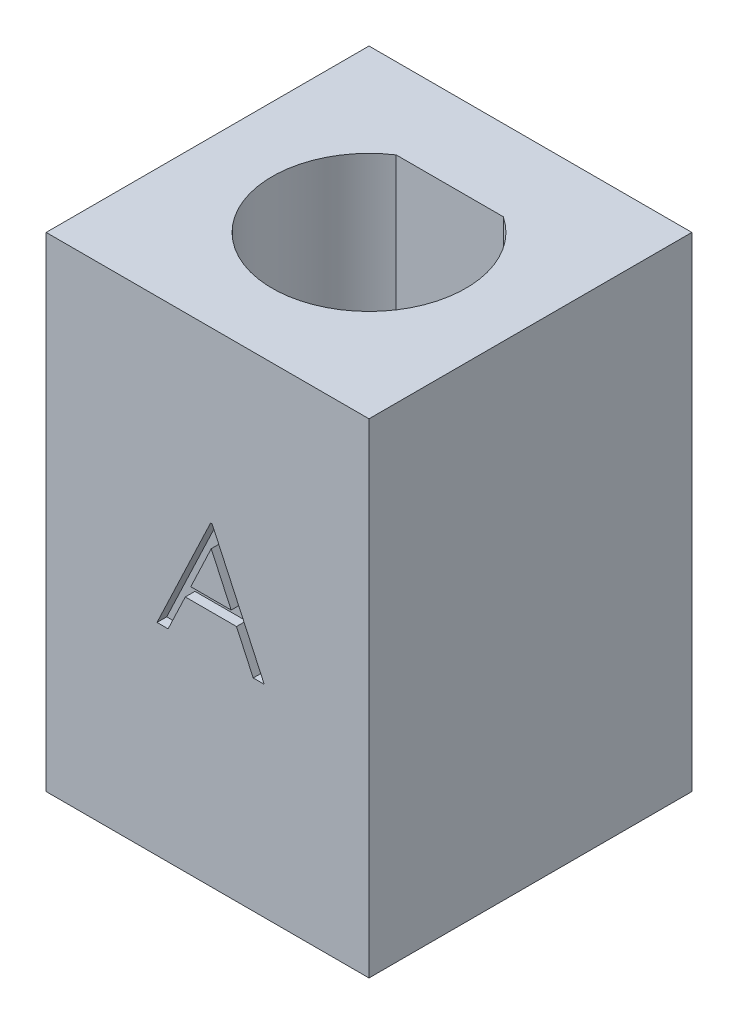
ISO-10303-21;
HEADER;
FILE_DESCRIPTION(('STEP AP214'),'2;1');
FILE_NAME('part.step','',(''),(''),'','','');
FILE_SCHEMA(('AUTOMOTIVE_DESIGN { 1 0 10303 214 1 1 1 1 }'));
ENDSEC;
DATA;
#1=APPLICATION_CONTEXT('core data for automotive mechanical design processes');
#2=APPLICATION_PROTOCOL_DEFINITION('international standard','automotive_design',2000,#1);
#3=PRODUCT_CONTEXT('',#1,'mechanical');
#4=PRODUCT('Part','Part','',(#3));
#5=PRODUCT_RELATED_PRODUCT_CATEGORY('part','',(#4));
#6=PRODUCT_DEFINITION_FORMATION('','',#4);
#7=PRODUCT_DEFINITION_CONTEXT('part definition',#1,'design');
#8=PRODUCT_DEFINITION('design','',#6,#7);
#9=PRODUCT_DEFINITION_SHAPE('','',#8);
#10=(LENGTH_UNIT() NAMED_UNIT(*) SI_UNIT(.MILLI.,.METRE.));
#11=(NAMED_UNIT(*) PLANE_ANGLE_UNIT() SI_UNIT($,.RADIAN.));
#12=(NAMED_UNIT(*) SI_UNIT($,.STERADIAN.) SOLID_ANGLE_UNIT());
#13=UNCERTAINTY_MEASURE_WITH_UNIT(LENGTH_MEASURE(1.E-05),#10,'distance_accuracy_value','');
#14=(GEOMETRIC_REPRESENTATION_CONTEXT(3) GLOBAL_UNCERTAINTY_ASSIGNED_CONTEXT((#13)) GLOBAL_UNIT_ASSIGNED_CONTEXT((#10,
#11,#12)) REPRESENTATION_CONTEXT('',''));
#15=CARTESIAN_POINT('',(0.,0.,0.));
#16=DIRECTION('',(0.,0.,1.));
#17=DIRECTION('',(1.,0.,0.));
#18=AXIS2_PLACEMENT_3D('',#15,#16,#17);
#19=CARTESIAN_POINT('',(-5.,15.,5.));
#20=DIRECTION('',(0.,0.,-1.));
#21=DIRECTION('',(-1.,0.,0.));
#22=AXIS2_PLACEMENT_3D('',#19,#20,#21);
#23=PLANE('',#22);
#24=DIRECTION('',(1.,0.,0.));
#25=VECTOR('',#24,1.);
#26=CARTESIAN_POINT('',(-5.,0.,5.));
#27=LINE('',#26,#25);
#28=CARTESIAN_POINT('',(-5.,0.,5.));
#29=VERTEX_POINT('',#28);
#30=CARTESIAN_POINT('',(5.,0.,5.));
#31=VERTEX_POINT('',#30);
#32=EDGE_CURVE('E327',#29,#31,#27,.T.);
#33=ORIENTED_EDGE('',*,*,#32,.T.);
#34=DIRECTION('',(0.,-1.,0.));
#35=VECTOR('',#34,1.);
#36=CARTESIAN_POINT('',(5.,15.,5.));
#37=LINE('',#36,#35);
#38=CARTESIAN_POINT('',(5.,15.,5.));
#39=VERTEX_POINT('',#38);
#40=EDGE_CURVE('E52',#39,#31,#37,.T.);
#41=ORIENTED_EDGE('',*,*,#40,.F.);
#42=DIRECTION('',(1.,0.,0.));
#43=VECTOR('',#42,1.);
#44=CARTESIAN_POINT('',(-5.,15.,5.));
#45=LINE('',#44,#43);
#46=CARTESIAN_POINT('',(-5.,15.,5.));
#47=VERTEX_POINT('',#46);
#48=EDGE_CURVE('E313',#47,#39,#45,.T.);
#49=ORIENTED_EDGE('',*,*,#48,.F.);
#50=DIRECTION('',(0.,-1.,0.));
#51=VECTOR('',#50,1.);
#52=CARTESIAN_POINT('',(-5.,15.,5.));
#53=LINE('',#52,#51);
#54=EDGE_CURVE('E11',#47,#29,#53,.T.);
#55=ORIENTED_EDGE('',*,*,#54,.T.);
#56=EDGE_LOOP('',(#33,#41,#49,#55));
#57=FACE_BOUND('',#56,.T.);
#58=DIRECTION('',(1.,0.,0.));
#59=VECTOR('',#58,1.);
#60=CARTESIAN_POINT('',(0.094663212809988,9.75483865440246,5.));
#61=LINE('',#60,#59);
#62=CARTESIAN_POINT('',(0.094663212809986,9.75483865440246,5.));
#63=VERTEX_POINT('',#62);
#64=CARTESIAN_POINT('',(0.139535007681783,9.75483865440246,5.));
#65=VERTEX_POINT('',#64);
#66=EDGE_CURVE('E59',#63,#65,#61,.T.);
#67=ORIENTED_EDGE('',*,*,#66,.T.);
#68=DIRECTION('',(0.419058177461747,-0.907959384500452,0.));
#69=VECTOR('',#68,1.);
#70=CARTESIAN_POINT('',(0.139535007681783,9.75483865440246,5.));
#71=LINE('',#70,#69);
#72=CARTESIAN_POINT('',(1.7549196230664,6.25483865440246,5.));
#73=VERTEX_POINT('',#72);
#74=EDGE_CURVE('E235',#65,#73,#71,.T.);
#75=ORIENTED_EDGE('',*,*,#74,.T.);
#76=DIRECTION('',(-1.,0.,0.));
#77=VECTOR('',#76,1.);
#78=CARTESIAN_POINT('',(1.7549196230664,6.25483865440246,5.));
#79=LINE('',#78,#77);
#80=CARTESIAN_POINT('',(1.41347330896383,6.25483865440246,5.));
#81=VERTEX_POINT('',#80);
#82=EDGE_CURVE('E239',#73,#81,#79,.T.);
#83=ORIENTED_EDGE('',*,*,#82,.T.);
#84=DIRECTION('',(-0.418842224744609,0.90805902383655,0.));
#85=VECTOR('',#84,1.);
#86=CARTESIAN_POINT('',(1.41347330896383,6.25483865440246,5.));
#87=LINE('',#86,#85);
#88=CARTESIAN_POINT('',(0.896045424348449,7.37663352619734,5.));
#89=VERTEX_POINT('',#88);
#90=EDGE_CURVE('E243',#81,#89,#87,.T.);
#91=ORIENTED_EDGE('',*,*,#90,.T.);
#92=DIRECTION('',(-1.,0.,0.));
#93=VECTOR('',#92,1.);
#94=CARTESIAN_POINT('',(0.896045424348449,7.37663352619734,5.));
#95=LINE('',#94,#93);
#96=CARTESIAN_POINT('',(-0.690593197446422,7.37663352619734,5.));
#97=VERTEX_POINT('',#96);
#98=EDGE_CURVE('E247',#89,#97,#95,.T.);
#99=ORIENTED_EDGE('',*,*,#98,.T.);
#100=DIRECTION('',(-0.428596026355544,-0.903496234741594,0.));
#101=VECTOR('',#100,1.);
#102=CARTESIAN_POINT('',(-0.690593197446422,7.37663352619734,5.));
#103=LINE('',#102,#101);
#104=CARTESIAN_POINT('',(-1.22274463975411,6.25483865440246,5.));
#105=VERTEX_POINT('',#104);
#106=EDGE_CURVE('E251',#97,#105,#103,.T.);
#107=ORIENTED_EDGE('',*,*,#106,.T.);
#108=DIRECTION('',(-1.,0.,0.));
#109=VECTOR('',#108,1.);
#110=CARTESIAN_POINT('',(-1.22274463975411,6.25483865440246,5.));
#111=LINE('',#110,#109);
#112=CARTESIAN_POINT('',(-1.56559319744642,6.25483865440246,5.));
#113=VERTEX_POINT('',#112);
#114=EDGE_CURVE('E255',#105,#113,#111,.T.);
#115=ORIENTED_EDGE('',*,*,#114,.T.);
#116=DIRECTION('',(0.428584206872173,0.903501841514311,0.));
#117=VECTOR('',#116,1.);
#118=CARTESIAN_POINT('',(-1.56559319744642,6.25483865440246,5.));
#119=LINE('',#118,#117);
#120=EDGE_CURVE('E211',#113,#63,#119,.T.);
#121=ORIENTED_EDGE('',*,*,#120,.T.);
#122=EDGE_LOOP('',(#67,#75,#83,#91,#99,#107,#115,#121));
#123=FACE_BOUND('',#122,.T.);
#124=ADVANCED_FACE('F43',(#57,#123),#23,.F.);
#125=CARTESIAN_POINT('',(0.,15.,0.));
#126=DIRECTION('',(0.,1.,0.));
#127=DIRECTION('',(0.,0.,1.));
#128=AXIS2_PLACEMENT_3D('',#125,#126,#127);
#129=PLANE('',#128);
#130=DIRECTION('',(0.,0.,1.));
#131=VECTOR('',#130,1.);
#132=CARTESIAN_POINT('',(-5.,15.,-5.));
#133=LINE('',#132,#131);
#134=CARTESIAN_POINT('',(-5.,15.,-5.));
#135=VERTEX_POINT('',#134);
#136=EDGE_CURVE('E309',#135,#47,#133,.T.);
#137=ORIENTED_EDGE('',*,*,#136,.T.);
#138=ORIENTED_EDGE('',*,*,#48,.T.);
#139=DIRECTION('',(0.,0.,-1.));
#140=VECTOR('',#139,1.);
#141=CARTESIAN_POINT('',(5.,15.,-5.));
#142=LINE('',#141,#140);
#143=CARTESIAN_POINT('',(5.,15.,-5.));
#144=VERTEX_POINT('',#143);
#145=EDGE_CURVE('E317',#39,#144,#142,.T.);
#146=ORIENTED_EDGE('',*,*,#145,.T.);
#147=DIRECTION('',(-1.,0.,0.));
#148=VECTOR('',#147,1.);
#149=CARTESIAN_POINT('',(-5.,15.,-5.));
#150=LINE('',#149,#148);
#151=EDGE_CURVE('E320',#144,#135,#150,.T.);
#152=ORIENTED_EDGE('',*,*,#151,.T.);
#153=EDGE_LOOP('',(#137,#138,#146,#152));
#154=FACE_BOUND('',#153,.T.);
#155=DIRECTION('',(-1.,0.,0.));
#156=VECTOR('',#155,1.);
#157=CARTESIAN_POINT('',(-1.6583123951777,15.,-2.5));
#158=LINE('',#157,#156);
#159=CARTESIAN_POINT('',(1.6583123951777,15.,-2.5));
#160=VERTEX_POINT('',#159);
#161=CARTESIAN_POINT('',(-1.6583123951777,15.,-2.5));
#162=VERTEX_POINT('',#161);
#163=EDGE_CURVE('E290',#160,#162,#158,.T.);
#164=ORIENTED_EDGE('',*,*,#163,.F.);
#165=CARTESIAN_POINT('',(0.,15.,0.));
#166=DIRECTION('',(0.,1.,0.));
#167=DIRECTION('',(0.,0.,1.));
#168=AXIS2_PLACEMENT_3D('',#165,#166,#167);
#169=CIRCLE('',#168,3.);
#170=EDGE_CURVE('E286',#162,#160,#169,.T.);
#171=ORIENTED_EDGE('',*,*,#170,.F.);
#172=EDGE_LOOP('',(#164,#171));
#173=FACE_BOUND('',#172,.T.);
#174=ADVANCED_FACE('F363',(#154,#173),#129,.T.);
#175=CARTESIAN_POINT('',(0.,0.,0.));
#176=DIRECTION('',(0.,1.,0.));
#177=DIRECTION('',(0.,0.,1.));
#178=AXIS2_PLACEMENT_3D('',#175,#176,#177);
#179=PLANE('',#178);
#180=DIRECTION('',(0.,0.,1.));
#181=VECTOR('',#180,1.);
#182=CARTESIAN_POINT('',(-5.,0.,-5.));
#183=LINE('',#182,#181);
#184=CARTESIAN_POINT('',(-5.,0.,-5.));
#185=VERTEX_POINT('',#184);
#186=EDGE_CURVE('E308',#185,#29,#183,.T.);
#187=ORIENTED_EDGE('',*,*,#186,.F.);
#188=DIRECTION('',(-1.,0.,0.));
#189=VECTOR('',#188,1.);
#190=CARTESIAN_POINT('',(-5.,0.,-5.));
#191=LINE('',#190,#189);
#192=CARTESIAN_POINT('',(5.,0.,-5.));
#193=VERTEX_POINT('',#192);
#194=EDGE_CURVE('E314',#193,#185,#191,.T.);
#195=ORIENTED_EDGE('',*,*,#194,.F.);
#196=DIRECTION('',(0.,0.,-1.));
#197=VECTOR('',#196,1.);
#198=CARTESIAN_POINT('',(5.,0.,-5.));
#199=LINE('',#198,#197);
#200=EDGE_CURVE('E330',#31,#193,#199,.T.);
#201=ORIENTED_EDGE('',*,*,#200,.F.);
#202=ORIENTED_EDGE('',*,*,#32,.F.);
#203=EDGE_LOOP('',(#187,#195,#201,#202));
#204=FACE_BOUND('',#203,.T.);
#205=CARTESIAN_POINT('',(0.,0.,0.));
#206=DIRECTION('',(0.,1.,0.));
#207=DIRECTION('',(0.,0.,1.));
#208=AXIS2_PLACEMENT_3D('',#205,#206,#207);
#209=CIRCLE('',#208,3.);
#210=CARTESIAN_POINT('',(-1.6583123951777,0.,-2.5));
#211=VERTEX_POINT('',#210);
#212=CARTESIAN_POINT('',(1.6583123951777,0.,-2.5));
#213=VERTEX_POINT('',#212);
#214=EDGE_CURVE('E285',#211,#213,#209,.T.);
#215=ORIENTED_EDGE('',*,*,#214,.T.);
#216=DIRECTION('',(-1.,0.,0.));
#217=VECTOR('',#216,1.);
#218=CARTESIAN_POINT('',(-1.6583123951777,0.,-2.5));
#219=LINE('',#218,#217);
#220=EDGE_CURVE('E291',#213,#211,#219,.T.);
#221=ORIENTED_EDGE('',*,*,#220,.T.);
#222=EDGE_LOOP('',(#215,#221));
#223=FACE_BOUND('',#222,.T.);
#224=ADVANCED_FACE('F353',(#204,#223),#179,.F.);
#225=CARTESIAN_POINT('',(-5.,15.,-5.));
#226=DIRECTION('',(1.,0.,0.));
#227=DIRECTION('',(0.,0.,-1.));
#228=AXIS2_PLACEMENT_3D('',#225,#226,#227);
#229=PLANE('',#228);
#230=ORIENTED_EDGE('',*,*,#186,.T.);
#231=ORIENTED_EDGE('',*,*,#54,.F.);
#232=ORIENTED_EDGE('',*,*,#136,.F.);
#233=DIRECTION('',(0.,-1.,0.));
#234=VECTOR('',#233,1.);
#235=CARTESIAN_POINT('',(-5.,15.,-5.));
#236=LINE('',#235,#234);
#237=EDGE_CURVE('E323',#135,#185,#236,.T.);
#238=ORIENTED_EDGE('',*,*,#237,.T.);
#239=EDGE_LOOP('',(#230,#231,#232,#238));
#240=FACE_BOUND('',#239,.T.);
#241=ADVANCED_FACE('F45',(#240),#229,.F.);
#242=CARTESIAN_POINT('',(5.,15.,-5.));
#243=DIRECTION('',(-1.,0.,0.));
#244=DIRECTION('',(0.,0.,1.));
#245=AXIS2_PLACEMENT_3D('',#242,#243,#244);
#246=PLANE('',#245);
#247=ORIENTED_EDGE('',*,*,#200,.T.);
#248=DIRECTION('',(0.,-1.,0.));
#249=VECTOR('',#248,1.);
#250=CARTESIAN_POINT('',(5.,15.,-5.));
#251=LINE('',#250,#249);
#252=EDGE_CURVE('E338',#144,#193,#251,.T.);
#253=ORIENTED_EDGE('',*,*,#252,.F.);
#254=ORIENTED_EDGE('',*,*,#145,.F.);
#255=ORIENTED_EDGE('',*,*,#40,.T.);
#256=EDGE_LOOP('',(#247,#253,#254,#255));
#257=FACE_BOUND('',#256,.T.);
#258=ADVANCED_FACE('F347',(#257),#246,.F.);
#259=CARTESIAN_POINT('',(-5.,15.,-5.));
#260=DIRECTION('',(0.,0.,1.));
#261=DIRECTION('',(1.,0.,0.));
#262=AXIS2_PLACEMENT_3D('',#259,#260,#261);
#263=PLANE('',#262);
#264=ORIENTED_EDGE('',*,*,#194,.T.);
#265=ORIENTED_EDGE('',*,*,#237,.F.);
#266=ORIENTED_EDGE('',*,*,#151,.F.);
#267=ORIENTED_EDGE('',*,*,#252,.T.);
#268=EDGE_LOOP('',(#264,#265,#266,#267));
#269=FACE_BOUND('',#268,.T.);
#270=ADVANCED_FACE('F357',(#269),#263,.F.);
#271=CARTESIAN_POINT('',(0.,15.,0.));
#272=DIRECTION('',(0.,-1.,0.));
#273=DIRECTION('',(0.,0.,-1.));
#274=AXIS2_PLACEMENT_3D('',#271,#272,#273);
#275=CYLINDRICAL_SURFACE('',#274,3.);
#276=ORIENTED_EDGE('',*,*,#214,.F.);
#277=DIRECTION('',(0.,-1.,0.));
#278=VECTOR('',#277,1.);
#279=CARTESIAN_POINT('',(-1.6583123951777,15.,-2.5));
#280=LINE('',#279,#278);
#281=EDGE_CURVE('E294',#162,#211,#280,.T.);
#282=ORIENTED_EDGE('',*,*,#281,.F.);
#283=ORIENTED_EDGE('',*,*,#170,.T.);
#284=DIRECTION('',(0.,-1.,0.));
#285=VECTOR('',#284,1.);
#286=CARTESIAN_POINT('',(1.6583123951777,15.,-2.5));
#287=LINE('',#286,#285);
#288=EDGE_CURVE('E304',#160,#213,#287,.T.);
#289=ORIENTED_EDGE('',*,*,#288,.T.);
#290=EDGE_LOOP('',(#276,#282,#283,#289));
#291=FACE_BOUND('',#290,.T.);
#292=ADVANCED_FACE('F426',(#291),#275,.F.);
#293=CARTESIAN_POINT('',(-1.6583123951777,15.,-2.5));
#294=DIRECTION('',(0.,0.,1.));
#295=DIRECTION('',(1.,0.,0.));
#296=AXIS2_PLACEMENT_3D('',#293,#294,#295);
#297=PLANE('',#296);
#298=ORIENTED_EDGE('',*,*,#220,.F.);
#299=ORIENTED_EDGE('',*,*,#288,.F.);
#300=ORIENTED_EDGE('',*,*,#163,.T.);
#301=ORIENTED_EDGE('',*,*,#281,.T.);
#302=EDGE_LOOP('',(#298,#299,#300,#301));
#303=FACE_BOUND('',#302,.T.);
#304=ADVANCED_FACE('F423',(#303),#297,.T.);
#305=CARTESIAN_POINT('',(0.094663212809988,9.75483865440246,4.7));
#306=DIRECTION('',(0.,-1.,0.));
#307=DIRECTION('',(0.,0.,-1.));
#308=AXIS2_PLACEMENT_3D('',#305,#306,#307);
#309=PLANE('',#308);
#310=ORIENTED_EDGE('',*,*,#66,.F.);
#311=DIRECTION('',(0.,0.,1.));
#312=VECTOR('',#311,1.);
#313=CARTESIAN_POINT('',(0.094663212809988,9.75483865440246,4.7));
#314=LINE('',#313,#312);
#315=CARTESIAN_POINT('',(0.094663212809988,9.75483865440246,4.7));
#316=VERTEX_POINT('',#315);
#317=EDGE_CURVE('E232',#316,#63,#314,.T.);
#318=ORIENTED_EDGE('',*,*,#317,.F.);
#319=DIRECTION('',(1.,0.,0.));
#320=VECTOR('',#319,1.);
#321=CARTESIAN_POINT('',(0.094663212809988,9.75483865440246,4.7));
#322=LINE('',#321,#320);
#323=CARTESIAN_POINT('',(0.139535007681783,9.75483865440246,4.7));
#324=VERTEX_POINT('',#323);
#325=EDGE_CURVE('E206',#316,#324,#322,.T.);
#326=ORIENTED_EDGE('',*,*,#325,.T.);
#327=DIRECTION('',(0.,0.,1.));
#328=VECTOR('',#327,1.);
#329=CARTESIAN_POINT('',(0.139535007681783,9.75483865440246,4.7));
#330=LINE('',#329,#328);
#331=EDGE_CURVE('E282',#324,#65,#330,.T.);
#332=ORIENTED_EDGE('',*,*,#331,.T.);
#333=EDGE_LOOP('',(#310,#318,#326,#332));
#334=FACE_BOUND('',#333,.T.);
#335=ADVANCED_FACE('F375',(#334),#309,.T.);
#336=CARTESIAN_POINT('',(0.139535007681783,9.75483865440246,4.7));
#337=DIRECTION('',(-0.907959384500452,-0.419058177461747,0.));
#338=DIRECTION('',(0.419058177461747,-0.907959384500452,0.));
#339=AXIS2_PLACEMENT_3D('',#336,#337,#338);
#340=PLANE('',#339);
#341=ORIENTED_EDGE('',*,*,#74,.F.);
#342=ORIENTED_EDGE('',*,*,#331,.F.);
#343=DIRECTION('',(0.419058177461747,-0.907959384500452,0.));
#344=VECTOR('',#343,1.);
#345=CARTESIAN_POINT('',(0.139535007681783,9.75483865440246,4.7));
#346=LINE('',#345,#344);
#347=CARTESIAN_POINT('',(1.7549196230664,6.25483865440246,4.7));
#348=VERTEX_POINT('',#347);
#349=EDGE_CURVE('E210',#324,#348,#346,.T.);
#350=ORIENTED_EDGE('',*,*,#349,.T.);
#351=DIRECTION('',(0.,0.,1.));
#352=VECTOR('',#351,1.);
#353=CARTESIAN_POINT('',(1.7549196230664,6.25483865440246,4.7));
#354=LINE('',#353,#352);
#355=EDGE_CURVE('E279',#348,#73,#354,.T.);
#356=ORIENTED_EDGE('',*,*,#355,.T.);
#357=EDGE_LOOP('',(#341,#342,#350,#356));
#358=FACE_BOUND('',#357,.T.);
#359=ADVANCED_FACE('F382',(#358),#340,.T.);
#360=CARTESIAN_POINT('',(1.7549196230664,6.25483865440246,4.7));
#361=DIRECTION('',(0.,1.,0.));
#362=DIRECTION('',(0.,0.,1.));
#363=AXIS2_PLACEMENT_3D('',#360,#361,#362);
#364=PLANE('',#363);
#365=ORIENTED_EDGE('',*,*,#82,.F.);
#366=ORIENTED_EDGE('',*,*,#355,.F.);
#367=DIRECTION('',(-1.,0.,0.));
#368=VECTOR('',#367,1.);
#369=CARTESIAN_POINT('',(1.7549196230664,6.25483865440246,4.7));
#370=LINE('',#369,#368);
#371=CARTESIAN_POINT('',(1.41347330896383,6.25483865440246,4.7));
#372=VERTEX_POINT('',#371);
#373=EDGE_CURVE('E214',#348,#372,#370,.T.);
#374=ORIENTED_EDGE('',*,*,#373,.T.);
#375=DIRECTION('',(0.,0.,1.));
#376=VECTOR('',#375,1.);
#377=CARTESIAN_POINT('',(1.41347330896383,6.25483865440246,4.7));
#378=LINE('',#377,#376);
#379=EDGE_CURVE('E276',#372,#81,#378,.T.);
#380=ORIENTED_EDGE('',*,*,#379,.T.);
#381=EDGE_LOOP('',(#365,#366,#374,#380));
#382=FACE_BOUND('',#381,.T.);
#383=ADVANCED_FACE('F385',(#382),#364,.T.);
#384=CARTESIAN_POINT('',(1.41347330896383,6.25483865440246,4.7));
#385=DIRECTION('',(0.908059023836549,0.418842224744608,0.));
#386=DIRECTION('',(-0.418842224744608,0.908059023836549,0.));
#387=AXIS2_PLACEMENT_3D('',#384,#385,#386);
#388=PLANE('',#387);
#389=ORIENTED_EDGE('',*,*,#90,.F.);
#390=ORIENTED_EDGE('',*,*,#379,.F.);
#391=DIRECTION('',(-0.418842224744609,0.90805902383655,0.));
#392=VECTOR('',#391,1.);
#393=CARTESIAN_POINT('',(1.41347330896383,6.25483865440246,4.7));
#394=LINE('',#393,#392);
#395=CARTESIAN_POINT('',(0.896045424348449,7.37663352619734,4.7));
#396=VERTEX_POINT('',#395);
#397=EDGE_CURVE('E217',#372,#396,#394,.T.);
#398=ORIENTED_EDGE('',*,*,#397,.T.);
#399=DIRECTION('',(0.,0.,1.));
#400=VECTOR('',#399,1.);
#401=CARTESIAN_POINT('',(0.896045424348449,7.37663352619734,4.7));
#402=LINE('',#401,#400);
#403=EDGE_CURVE('E273',#396,#89,#402,.T.);
#404=ORIENTED_EDGE('',*,*,#403,.T.);
#405=EDGE_LOOP('',(#389,#390,#398,#404));
#406=FACE_BOUND('',#405,.T.);
#407=ADVANCED_FACE('F390',(#406),#388,.T.);
#408=CARTESIAN_POINT('',(0.896045424348449,7.37663352619734,4.7));
#409=DIRECTION('',(0.,1.,0.));
#410=DIRECTION('',(0.,0.,1.));
#411=AXIS2_PLACEMENT_3D('',#408,#409,#410);
#412=PLANE('',#411);
#413=ORIENTED_EDGE('',*,*,#98,.F.);
#414=ORIENTED_EDGE('',*,*,#403,.F.);
#415=DIRECTION('',(-1.,0.,0.));
#416=VECTOR('',#415,1.);
#417=CARTESIAN_POINT('',(0.896045424348449,7.37663352619734,4.7));
#418=LINE('',#417,#416);
#419=CARTESIAN_POINT('',(-0.690593197446422,7.37663352619734,4.7));
#420=VERTEX_POINT('',#419);
#421=EDGE_CURVE('E220',#396,#420,#418,.T.);
#422=ORIENTED_EDGE('',*,*,#421,.T.);
#423=DIRECTION('',(0.,0.,1.));
#424=VECTOR('',#423,1.);
#425=CARTESIAN_POINT('',(-0.690593197446422,7.37663352619734,4.7));
#426=LINE('',#425,#424);
#427=EDGE_CURVE('E270',#420,#97,#426,.T.);
#428=ORIENTED_EDGE('',*,*,#427,.T.);
#429=EDGE_LOOP('',(#413,#414,#422,#428));
#430=FACE_BOUND('',#429,.T.);
#431=ADVANCED_FACE('F394',(#430),#412,.T.);
#432=CARTESIAN_POINT('',(-0.690593197446422,7.37663352619734,4.7));
#433=DIRECTION('',(-0.903496234741594,0.428596026355544,0.));
#434=DIRECTION('',(-0.428596026355544,-0.903496234741594,0.));
#435=AXIS2_PLACEMENT_3D('',#432,#433,#434);
#436=PLANE('',#435);
#437=ORIENTED_EDGE('',*,*,#106,.F.);
#438=ORIENTED_EDGE('',*,*,#427,.F.);
#439=DIRECTION('',(-0.428596026355544,-0.903496234741594,0.));
#440=VECTOR('',#439,1.);
#441=CARTESIAN_POINT('',(-0.690593197446422,7.37663352619734,4.7));
#442=LINE('',#441,#440);
#443=CARTESIAN_POINT('',(-1.22274463975411,6.25483865440246,4.7));
#444=VERTEX_POINT('',#443);
#445=EDGE_CURVE('E223',#420,#444,#442,.T.);
#446=ORIENTED_EDGE('',*,*,#445,.T.);
#447=DIRECTION('',(0.,0.,1.));
#448=VECTOR('',#447,1.);
#449=CARTESIAN_POINT('',(-1.22274463975411,6.25483865440246,4.7));
#450=LINE('',#449,#448);
#451=EDGE_CURVE('E267',#444,#105,#450,.T.);
#452=ORIENTED_EDGE('',*,*,#451,.T.);
#453=EDGE_LOOP('',(#437,#438,#446,#452));
#454=FACE_BOUND('',#453,.T.);
#455=ADVANCED_FACE('F399',(#454),#436,.T.);
#456=CARTESIAN_POINT('',(-1.22274463975411,6.25483865440246,4.7));
#457=DIRECTION('',(0.,1.,0.));
#458=DIRECTION('',(0.,0.,1.));
#459=AXIS2_PLACEMENT_3D('',#456,#457,#458);
#460=PLANE('',#459);
#461=ORIENTED_EDGE('',*,*,#114,.F.);
#462=ORIENTED_EDGE('',*,*,#451,.F.);
#463=DIRECTION('',(-1.,0.,0.));
#464=VECTOR('',#463,1.);
#465=CARTESIAN_POINT('',(-1.22274463975411,6.25483865440246,4.7));
#466=LINE('',#465,#464);
#467=CARTESIAN_POINT('',(-1.56559319744642,6.25483865440246,4.7));
#468=VERTEX_POINT('',#467);
#469=EDGE_CURVE('E226',#444,#468,#466,.T.);
#470=ORIENTED_EDGE('',*,*,#469,.T.);
#471=DIRECTION('',(0.,0.,1.));
#472=VECTOR('',#471,1.);
#473=CARTESIAN_POINT('',(-1.56559319744642,6.25483865440246,4.7));
#474=LINE('',#473,#472);
#475=EDGE_CURVE('E264',#468,#113,#474,.T.);
#476=ORIENTED_EDGE('',*,*,#475,.T.);
#477=EDGE_LOOP('',(#461,#462,#470,#476));
#478=FACE_BOUND('',#477,.T.);
#479=ADVANCED_FACE('F402',(#478),#460,.T.);
#480=CARTESIAN_POINT('',(-1.56559319744642,6.25483865440246,4.7));
#481=DIRECTION('',(0.903501841514311,-0.428584206872173,0.));
#482=DIRECTION('',(0.428584206872173,0.903501841514311,0.));
#483=AXIS2_PLACEMENT_3D('',#480,#481,#482);
#484=PLANE('',#483);
#485=ORIENTED_EDGE('',*,*,#120,.F.);
#486=ORIENTED_EDGE('',*,*,#475,.F.);
#487=DIRECTION('',(0.428584206872173,0.903501841514311,0.));
#488=VECTOR('',#487,1.);
#489=CARTESIAN_POINT('',(-1.56559319744642,6.25483865440246,4.7));
#490=LINE('',#489,#488);
#491=EDGE_CURVE('E229',#468,#316,#490,.T.);
#492=ORIENTED_EDGE('',*,*,#491,.T.);
#493=ORIENTED_EDGE('',*,*,#317,.T.);
#494=EDGE_LOOP('',(#485,#486,#492,#493));
#495=FACE_BOUND('',#494,.T.);
#496=ADVANCED_FACE('F372',(#495),#484,.T.);
#497=CARTESIAN_POINT('',(0.,0.,4.7));
#498=DIRECTION('',(0.,0.,1.));
#499=DIRECTION('',(1.,0.,0.));
#500=AXIS2_PLACEMENT_3D('',#497,#498,#499);
#501=PLANE('',#500);
#502=DIRECTION('',(1.,0.,0.));
#503=VECTOR('',#502,1.);
#504=CARTESIAN_POINT('',(-0.520220601292576,7.73560788517169,4.7));
#505=LINE('',#504,#503);
#506=CARTESIAN_POINT('',(-0.520220601292576,7.7356078851717,4.7));
#507=VERTEX_POINT('',#506);
#508=CARTESIAN_POINT('',(0.730580680758706,7.73560788517169,4.7));
#509=VERTEX_POINT('',#508);
#510=EDGE_CURVE('E178',#507,#509,#505,.T.);
#511=ORIENTED_EDGE('',*,*,#510,.F.);
#512=DIRECTION('',(-0.428351119156279,-0.903612371936974,0.));
#513=VECTOR('',#512,1.);
#514=CARTESIAN_POINT('',(0.113593501271526,9.07264714799221,4.7));
#515=LINE('',#514,#513);
#516=CARTESIAN_POINT('',(0.113593501271526,9.07264714799221,4.7));
#517=VERTEX_POINT('',#516);
#518=EDGE_CURVE('E169',#517,#507,#515,.T.);
#519=ORIENTED_EDGE('',*,*,#518,.F.);
#520=DIRECTION('',(-0.418997788826975,0.907987253742092,0.));
#521=VECTOR('',#520,1.);
#522=CARTESIAN_POINT('',(0.730580680758706,7.73560788517169,4.7));
#523=LINE('',#522,#521);
#524=EDGE_CURVE('E184',#509,#517,#523,.T.);
#525=ORIENTED_EDGE('',*,*,#524,.F.);
#526=EDGE_LOOP('',(#511,#519,#525));
#527=FACE_BOUND('',#526,.T.);
#528=ORIENTED_EDGE('',*,*,#325,.F.);
#529=ORIENTED_EDGE('',*,*,#491,.F.);
#530=ORIENTED_EDGE('',*,*,#469,.F.);
#531=ORIENTED_EDGE('',*,*,#445,.F.);
#532=ORIENTED_EDGE('',*,*,#421,.F.);
#533=ORIENTED_EDGE('',*,*,#397,.F.);
#534=ORIENTED_EDGE('',*,*,#373,.F.);
#535=ORIENTED_EDGE('',*,*,#349,.F.);
#536=EDGE_LOOP('',(#528,#529,#530,#531,#532,#533,#534,#535));
#537=FACE_BOUND('',#536,.T.);
#538=ADVANCED_FACE('F182',(#527,#537),#501,.T.);
#539=CARTESIAN_POINT('',(0.730580680758706,7.73560788517169,4.7));
#540=DIRECTION('',(0.907987253742092,0.418997788826975,0.));
#541=DIRECTION('',(-0.418997788826975,0.907987253742092,0.));
#542=AXIS2_PLACEMENT_3D('',#539,#540,#541);
#543=PLANE('',#542);
#544=DIRECTION('',(-0.418997788826975,0.907987253742092,0.));
#545=VECTOR('',#544,1.);
#546=CARTESIAN_POINT('',(0.730580680758706,7.73560788517169,5.));
#547=LINE('',#546,#545);
#548=CARTESIAN_POINT('',(0.730580680758706,7.73560788517169,5.));
#549=VERTEX_POINT('',#548);
#550=CARTESIAN_POINT('',(0.113593501271526,9.07264714799221,5.));
#551=VERTEX_POINT('',#550);
#552=EDGE_CURVE('E197',#549,#551,#547,.T.);
#553=ORIENTED_EDGE('',*,*,#552,.F.);
#554=DIRECTION('',(0.,0.,1.));
#555=VECTOR('',#554,1.);
#556=CARTESIAN_POINT('',(0.730580680758706,7.73560788517169,4.7));
#557=LINE('',#556,#555);
#558=EDGE_CURVE('E189',#509,#549,#557,.T.);
#559=ORIENTED_EDGE('',*,*,#558,.F.);
#560=ORIENTED_EDGE('',*,*,#524,.T.);
#561=DIRECTION('',(0.,0.,1.));
#562=VECTOR('',#561,1.);
#563=CARTESIAN_POINT('',(0.113593501271526,9.07264714799221,4.7));
#564=LINE('',#563,#562);
#565=EDGE_CURVE('E166',#517,#551,#564,.T.);
#566=ORIENTED_EDGE('',*,*,#565,.T.);
#567=EDGE_LOOP('',(#553,#559,#560,#566));
#568=FACE_BOUND('',#567,.T.);
#569=ADVANCED_FACE('F188',(#568),#543,.T.);
#570=CARTESIAN_POINT('',(-0.520220601292576,7.73560788517169,4.7));
#571=DIRECTION('',(0.,-1.,0.));
#572=DIRECTION('',(0.,0.,-1.));
#573=AXIS2_PLACEMENT_3D('',#570,#571,#572);
#574=PLANE('',#573);
#575=DIRECTION('',(1.,0.,0.));
#576=VECTOR('',#575,1.);
#577=CARTESIAN_POINT('',(-0.520220601292576,7.73560788517169,5.));
#578=LINE('',#577,#576);
#579=CARTESIAN_POINT('',(-0.520220601292576,7.7356078851717,5.));
#580=VERTEX_POINT('',#579);
#581=EDGE_CURVE('E67',#580,#549,#578,.T.);
#582=ORIENTED_EDGE('',*,*,#581,.F.);
#583=DIRECTION('',(0.,0.,1.));
#584=VECTOR('',#583,1.);
#585=CARTESIAN_POINT('',(-0.520220601292576,7.73560788517169,4.7));
#586=LINE('',#585,#584);
#587=EDGE_CURVE('E177',#507,#580,#586,.T.);
#588=ORIENTED_EDGE('',*,*,#587,.F.);
#589=ORIENTED_EDGE('',*,*,#510,.T.);
#590=ORIENTED_EDGE('',*,*,#558,.T.);
#591=EDGE_LOOP('',(#582,#588,#589,#590));
#592=FACE_BOUND('',#591,.T.);
#593=ADVANCED_FACE('F531',(#592),#574,.T.);
#594=CARTESIAN_POINT('',(0.113593501271526,9.07264714799221,4.7));
#595=DIRECTION('',(-0.903612371936974,0.428351119156279,0.));
#596=DIRECTION('',(-0.428351119156279,-0.903612371936974,0.));
#597=AXIS2_PLACEMENT_3D('',#594,#595,#596);
#598=PLANE('',#597);
#599=DIRECTION('',(-0.428351119156279,-0.903612371936974,0.));
#600=VECTOR('',#599,1.);
#601=CARTESIAN_POINT('',(0.113593501271526,9.07264714799221,5.));
#602=LINE('',#601,#600);
#603=EDGE_CURVE('E171',#551,#580,#602,.T.);
#604=ORIENTED_EDGE('',*,*,#603,.F.);
#605=ORIENTED_EDGE('',*,*,#565,.F.);
#606=ORIENTED_EDGE('',*,*,#518,.T.);
#607=ORIENTED_EDGE('',*,*,#587,.T.);
#608=EDGE_LOOP('',(#604,#605,#606,#607));
#609=FACE_BOUND('',#608,.T.);
#610=ADVANCED_FACE('F168',(#609),#598,.T.);
#611=ORIENTED_EDGE('',*,*,#552,.T.);
#612=ORIENTED_EDGE('',*,*,#603,.T.);
#613=ORIENTED_EDGE('',*,*,#581,.T.);
#614=EDGE_LOOP('',(#611,#612,#613));
#615=FACE_BOUND('',#614,.T.);
#616=ADVANCED_FACE('F367',(#615),#23,.F.);
#617=CLOSED_SHELL('',(#124,#174,#224,#241,#258,#270,#292,#304,#335,#359,#383,#407,#431,#455,
#479,#496,#538,#569,#593,#610,#616));
#618=MANIFOLD_SOLID_BREP('B2',#617);
#619=ADVANCED_BREP_SHAPE_REPRESENTATION('',(#18,#618),#14);
#620=SHAPE_DEFINITION_REPRESENTATION(#9,#619);
ENDSEC;
END-ISO-10303-21;
